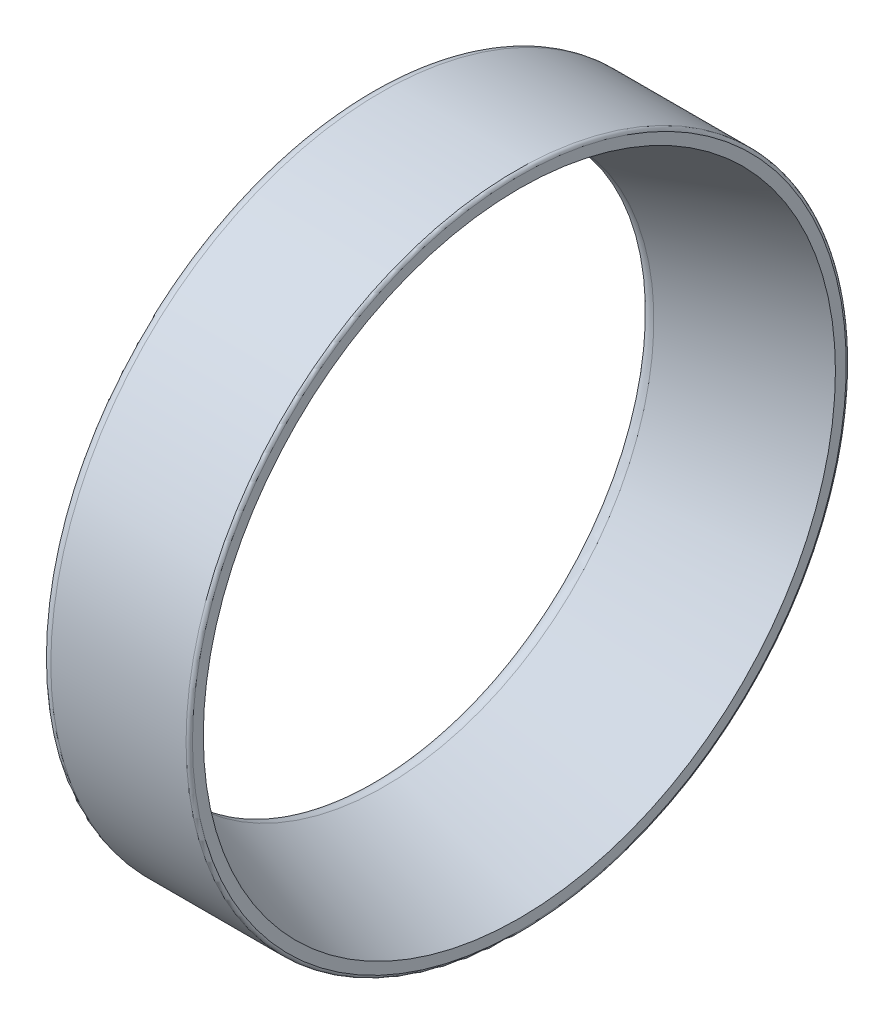
ISO-10303-21;
HEADER;
FILE_DESCRIPTION(('STEP AP214'),'2;1');
FILE_NAME('part.step','',(''),(''),'','','');
FILE_SCHEMA(('AUTOMOTIVE_DESIGN { 1 0 10303 214 1 1 1 1 }'));
ENDSEC;
DATA;
#1=APPLICATION_CONTEXT('core data for automotive mechanical design processes');
#2=APPLICATION_PROTOCOL_DEFINITION('international standard','automotive_design',2000,#1);
#3=PRODUCT_CONTEXT('',#1,'mechanical');
#4=PRODUCT('Part','Part','',(#3));
#5=PRODUCT_RELATED_PRODUCT_CATEGORY('part','',(#4));
#6=PRODUCT_DEFINITION_FORMATION('','',#4);
#7=PRODUCT_DEFINITION_CONTEXT('part definition',#1,'design');
#8=PRODUCT_DEFINITION('design','',#6,#7);
#9=PRODUCT_DEFINITION_SHAPE('','',#8);
#10=(LENGTH_UNIT() NAMED_UNIT(*) SI_UNIT(.MILLI.,.METRE.));
#11=(NAMED_UNIT(*) PLANE_ANGLE_UNIT() SI_UNIT($,.RADIAN.));
#12=(NAMED_UNIT(*) SI_UNIT($,.STERADIAN.) SOLID_ANGLE_UNIT());
#13=UNCERTAINTY_MEASURE_WITH_UNIT(LENGTH_MEASURE(1.E-05),#10,'distance_accuracy_value','');
#14=(GEOMETRIC_REPRESENTATION_CONTEXT(3) GLOBAL_UNCERTAINTY_ASSIGNED_CONTEXT((#13)) GLOBAL_UNIT_ASSIGNED_CONTEXT((#10,
#11,#12)) REPRESENTATION_CONTEXT('',''));
#15=CARTESIAN_POINT('',(0.,0.,0.));
#16=DIRECTION('',(0.,0.,1.));
#17=DIRECTION('',(1.,0.,0.));
#18=AXIS2_PLACEMENT_3D('',#15,#16,#17);
#19=CARTESIAN_POINT('',(1.,0.,0.));
#20=DIRECTION('',(-1.,0.,0.));
#21=DIRECTION('',(0.,0.,1.));
#22=AXIS2_PLACEMENT_3D('',#19,#20,#21);
#23=TOROIDAL_SURFACE('',#22,26.251062484103,1.);
#24=CARTESIAN_POINT('',(1.32637716446618,0.,0.));
#25=DIRECTION('',(-1.,0.,0.));
#26=DIRECTION('',(0.,0.,1.));
#27=AXIS2_PLACEMENT_3D('',#24,#25,#26);
#28=CIRCLE('',#27,25.3058228602429);
#29=CARTESIAN_POINT('',(1.32637716446618,0.,25.3058228602429));
#30=VERTEX_POINT('',#29);
#31=EDGE_CURVE('E10',#30,#30,#28,.T.);
#32=ORIENTED_EDGE('',*,*,#31,.F.);
#33=EDGE_LOOP('',(#32));
#34=FACE_BOUND('',#33,.T.);
#35=CARTESIAN_POINT('',(0.,0.,0.));
#36=DIRECTION('',(-1.,0.,0.));
#37=DIRECTION('',(0.,0.,1.));
#38=AXIS2_PLACEMENT_3D('',#35,#36,#37);
#39=CIRCLE('',#38,26.251062484103);
#40=CARTESIAN_POINT('',(0.,0.,26.251062484103));
#41=VERTEX_POINT('',#40);
#42=EDGE_CURVE('E52',#41,#41,#39,.T.);
#43=ORIENTED_EDGE('',*,*,#42,.T.);
#44=EDGE_LOOP('',(#43));
#45=FACE_BOUND('',#44,.T.);
#46=ADVANCED_FACE('F14',(#34,#45),#23,.T.);
#47=CARTESIAN_POINT('',(1.32637716446618,0.,0.));
#48=DIRECTION('',(1.,0.,0.));
#49=DIRECTION('',(0.,0.,-1.));
#50=AXIS2_PLACEMENT_3D('',#47,#48,#49);
#51=CONICAL_SURFACE('',#50,25.3058228602429,0.332468309777692);
#52=CARTESIAN_POINT('',(14.,0.,0.));
#53=DIRECTION('',(-1.,0.,0.));
#54=DIRECTION('',(0.,0.,1.));
#55=AXIS2_PLACEMENT_3D('',#52,#53,#54);
#56=CIRCLE('',#55,29.6818360744202);
#57=CARTESIAN_POINT('',(14.,0.,29.6818360744202));
#58=VERTEX_POINT('',#57);
#59=EDGE_CURVE('E21',#58,#58,#56,.T.);
#60=ORIENTED_EDGE('',*,*,#59,.F.);
#61=EDGE_LOOP('',(#60));
#62=FACE_BOUND('',#61,.T.);
#63=ORIENTED_EDGE('',*,*,#31,.T.);
#64=EDGE_LOOP('',(#63));
#65=FACE_BOUND('',#64,.T.);
#66=ADVANCED_FACE('F84',(#62,#65),#51,.F.);
#67=CARTESIAN_POINT('',(14.,29.6818360744202,0.));
#68=DIRECTION('',(-1.,0.,0.));
#69=DIRECTION('',(0.,0.,1.));
#70=AXIS2_PLACEMENT_3D('',#67,#68,#69);
#71=PLANE('',#70);
#72=CARTESIAN_POINT('',(14.,0.,0.));
#73=DIRECTION('',(-1.,0.,0.));
#74=DIRECTION('',(0.,0.,1.));
#75=AXIS2_PLACEMENT_3D('',#72,#73,#74);
#76=CIRCLE('',#75,30.7);
#77=CARTESIAN_POINT('',(14.,0.,30.7));
#78=VERTEX_POINT('',#77);
#79=EDGE_CURVE('E30',#78,#78,#76,.T.);
#80=ORIENTED_EDGE('',*,*,#79,.F.);
#81=EDGE_LOOP('',(#80));
#82=FACE_BOUND('',#81,.T.);
#83=ORIENTED_EDGE('',*,*,#59,.T.);
#84=EDGE_LOOP('',(#83));
#85=FACE_BOUND('',#84,.T.);
#86=ADVANCED_FACE('F79',(#82,#85),#71,.F.);
#87=CARTESIAN_POINT('',(13.7,0.,0.));
#88=DIRECTION('',(-1.,0.,0.));
#89=DIRECTION('',(0.,0.,1.));
#90=AXIS2_PLACEMENT_3D('',#87,#88,#89);
#91=TOROIDAL_SURFACE('',#90,30.7,0.3);
#92=CARTESIAN_POINT('',(13.7,0.,0.));
#93=DIRECTION('',(-1.,0.,0.));
#94=DIRECTION('',(0.,0.,1.));
#95=AXIS2_PLACEMENT_3D('',#92,#93,#94);
#96=CIRCLE('',#95,31.);
#97=CARTESIAN_POINT('',(13.7,0.,31.));
#98=VERTEX_POINT('',#97);
#99=EDGE_CURVE('E38',#98,#98,#96,.T.);
#100=ORIENTED_EDGE('',*,*,#99,.F.);
#101=EDGE_LOOP('',(#100));
#102=FACE_BOUND('',#101,.T.);
#103=ORIENTED_EDGE('',*,*,#79,.T.);
#104=EDGE_LOOP('',(#103));
#105=FACE_BOUND('',#104,.T.);
#106=ADVANCED_FACE('F73',(#102,#105),#91,.T.);
#107=CARTESIAN_POINT('',(1.,0.,0.));
#108=DIRECTION('',(-1.,0.,0.));
#109=DIRECTION('',(0.,0.,1.));
#110=AXIS2_PLACEMENT_3D('',#107,#108,#109);
#111=CYLINDRICAL_SURFACE('',#110,31.);
#112=CARTESIAN_POINT('',(1.,0.,0.));
#113=DIRECTION('',(-1.,0.,0.));
#114=DIRECTION('',(0.,0.,1.));
#115=AXIS2_PLACEMENT_3D('',#112,#113,#114);
#116=CIRCLE('',#115,31.);
#117=CARTESIAN_POINT('',(1.,0.,31.));
#118=VERTEX_POINT('',#117);
#119=EDGE_CURVE('E44',#118,#118,#116,.T.);
#120=ORIENTED_EDGE('',*,*,#119,.F.);
#121=EDGE_LOOP('',(#120));
#122=FACE_BOUND('',#121,.T.);
#123=ORIENTED_EDGE('',*,*,#99,.T.);
#124=EDGE_LOOP('',(#123));
#125=FACE_BOUND('',#124,.T.);
#126=ADVANCED_FACE('F67',(#122,#125),#111,.T.);
#127=CARTESIAN_POINT('',(1.,0.,0.));
#128=DIRECTION('',(-1.,0.,0.));
#129=DIRECTION('',(0.,0.,1.));
#130=AXIS2_PLACEMENT_3D('',#127,#128,#129);
#131=TOROIDAL_SURFACE('',#130,30.,1.);
#132=CARTESIAN_POINT('',(0.,0.,0.));
#133=DIRECTION('',(-1.,0.,0.));
#134=DIRECTION('',(0.,0.,1.));
#135=AXIS2_PLACEMENT_3D('',#132,#133,#134);
#136=CIRCLE('',#135,30.);
#137=CARTESIAN_POINT('',(0.,0.,30.));
#138=VERTEX_POINT('',#137);
#139=EDGE_CURVE('E48',#138,#138,#136,.T.);
#140=ORIENTED_EDGE('',*,*,#139,.F.);
#141=EDGE_LOOP('',(#140));
#142=FACE_BOUND('',#141,.T.);
#143=ORIENTED_EDGE('',*,*,#119,.T.);
#144=EDGE_LOOP('',(#143));
#145=FACE_BOUND('',#144,.T.);
#146=ADVANCED_FACE('F61',(#142,#145),#131,.T.);
#147=CARTESIAN_POINT('',(0.,30.,0.));
#148=DIRECTION('',(1.,0.,0.));
#149=DIRECTION('',(0.,0.,-1.));
#150=AXIS2_PLACEMENT_3D('',#147,#148,#149);
#151=PLANE('',#150);
#152=ORIENTED_EDGE('',*,*,#42,.F.);
#153=EDGE_LOOP('',(#152));
#154=FACE_BOUND('',#153,.T.);
#155=ORIENTED_EDGE('',*,*,#139,.T.);
#156=EDGE_LOOP('',(#155));
#157=FACE_BOUND('',#156,.T.);
#158=ADVANCED_FACE('F58',(#154,#157),#151,.F.);
#159=CLOSED_SHELL('',(#46,#66,#86,#106,#126,#146,#158));
#160=MANIFOLD_SOLID_BREP('B1',#159);
#161=ADVANCED_BREP_SHAPE_REPRESENTATION('',(#18,#160),#14);
#162=SHAPE_DEFINITION_REPRESENTATION(#9,#161);
ENDSEC;
END-ISO-10303-21;
